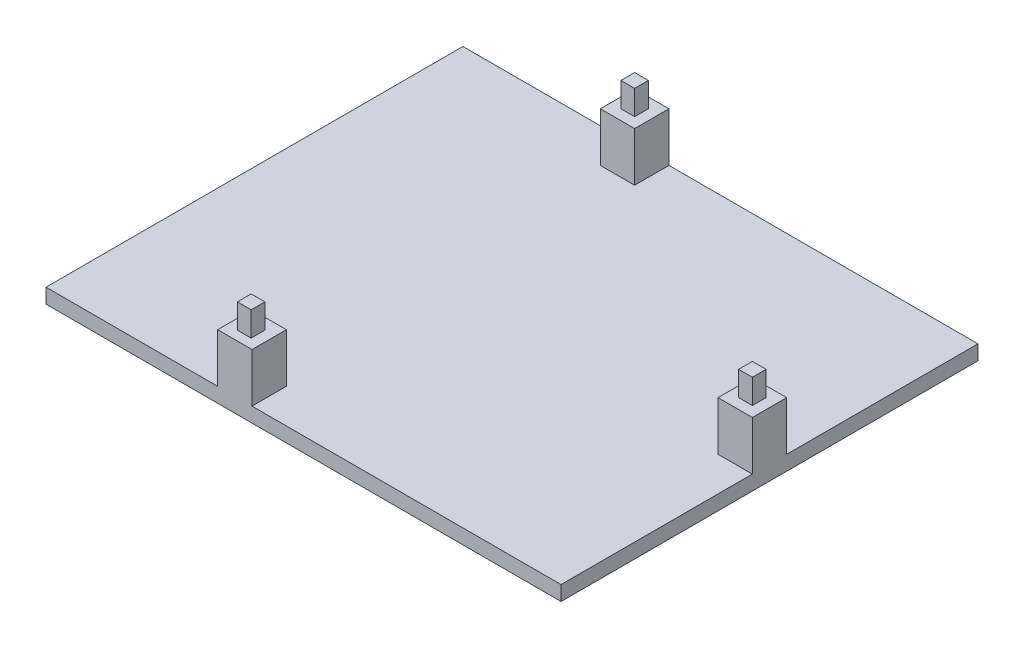
ISO-10303-21;
HEADER;
FILE_DESCRIPTION(('STEP AP214'),'2;1');
FILE_NAME('part.step','',(''),(''),'','','');
FILE_SCHEMA(('AUTOMOTIVE_DESIGN { 1 0 10303 214 1 1 1 1 }'));
ENDSEC;
DATA;
#1=APPLICATION_CONTEXT('core data for automotive mechanical design processes');
#2=APPLICATION_PROTOCOL_DEFINITION('international standard','automotive_design',2000,#1);
#3=PRODUCT_CONTEXT('',#1,'mechanical');
#4=PRODUCT('Part','Part','',(#3));
#5=PRODUCT_RELATED_PRODUCT_CATEGORY('part','',(#4));
#6=PRODUCT_DEFINITION_FORMATION('','',#4);
#7=PRODUCT_DEFINITION_CONTEXT('part definition',#1,'design');
#8=PRODUCT_DEFINITION('design','',#6,#7);
#9=PRODUCT_DEFINITION_SHAPE('','',#8);
#10=(LENGTH_UNIT() NAMED_UNIT(*) SI_UNIT(.MILLI.,.METRE.));
#11=(NAMED_UNIT(*) PLANE_ANGLE_UNIT() SI_UNIT($,.RADIAN.));
#12=(NAMED_UNIT(*) SI_UNIT($,.STERADIAN.) SOLID_ANGLE_UNIT());
#13=UNCERTAINTY_MEASURE_WITH_UNIT(LENGTH_MEASURE(1.E-05),#10,'distance_accuracy_value','');
#14=(GEOMETRIC_REPRESENTATION_CONTEXT(3) GLOBAL_UNCERTAINTY_ASSIGNED_CONTEXT((#13)) GLOBAL_UNIT_ASSIGNED_CONTEXT((#10,
#11,#12)) REPRESENTATION_CONTEXT('',''));
#15=CARTESIAN_POINT('',(0.,0.,0.));
#16=DIRECTION('',(0.,0.,1.));
#17=DIRECTION('',(1.,0.,0.));
#18=AXIS2_PLACEMENT_3D('',#15,#16,#17);
#19=CARTESIAN_POINT('',(0.,3.,0.));
#20=DIRECTION('',(0.,-1.,0.));
#21=DIRECTION('',(0.,0.,-1.));
#22=AXIS2_PLACEMENT_3D('',#19,#20,#21);
#23=PLANE('',#22);
#24=DIRECTION('',(0.,0.,-1.));
#25=VECTOR('',#24,1.);
#26=CARTESIAN_POINT('',(35.2097502972652,3.,0.));
#27=LINE('',#26,#25);
#28=CARTESIAN_POINT('',(35.2097502972652,3.,20.7510107015458));
#29=VERTEX_POINT('',#28);
#30=CARTESIAN_POINT('',(35.2097502972652,3.,13.7510107015458));
#31=VERTEX_POINT('',#30);
#32=EDGE_CURVE('E50',#29,#31,#27,.T.);
#33=ORIENTED_EDGE('',*,*,#32,.T.);
#34=DIRECTION('',(1.,0.,0.));
#35=VECTOR('',#34,1.);
#36=CARTESIAN_POINT('',(0.,3.,13.7510107015458));
#37=LINE('',#36,#35);
#38=CARTESIAN_POINT('',(42.2097502972652,3.,13.7510107015458));
#39=VERTEX_POINT('',#38);
#40=EDGE_CURVE('E225',#31,#39,#37,.T.);
#41=ORIENTED_EDGE('',*,*,#40,.T.);
#42=DIRECTION('',(0.,0.,-1.));
#43=VECTOR('',#42,1.);
#44=CARTESIAN_POINT('',(42.2097502972652,3.,-25.2489892984542));
#45=LINE('',#44,#43);
#46=CARTESIAN_POINT('',(42.2097502972652,3.,-25.2489892984542));
#47=VERTEX_POINT('',#46);
#48=EDGE_CURVE('E426',#39,#47,#45,.T.);
#49=ORIENTED_EDGE('',*,*,#48,.T.);
#50=DIRECTION('',(-1.,0.,0.));
#51=VECTOR('',#50,1.);
#52=CARTESIAN_POINT('',(-62.7902497027348,3.,-25.2489892984542));
#53=LINE('',#52,#51);
#54=CARTESIAN_POINT('',(-20.7902497027348,3.,-25.2489892984542));
#55=VERTEX_POINT('',#54);
#56=EDGE_CURVE('E430',#47,#55,#53,.T.);
#57=ORIENTED_EDGE('',*,*,#56,.T.);
#58=DIRECTION('',(0.,0.,-1.));
#59=VECTOR('',#58,1.);
#60=CARTESIAN_POINT('',(-20.7902497027348,3.,0.));
#61=LINE('',#60,#59);
#62=CARTESIAN_POINT('',(-20.7902497027348,3.,-18.2489892984542));
#63=VERTEX_POINT('',#62);
#64=EDGE_CURVE('E317',#63,#55,#61,.T.);
#65=ORIENTED_EDGE('',*,*,#64,.F.);
#66=DIRECTION('',(1.,0.,0.));
#67=VECTOR('',#66,1.);
#68=CARTESIAN_POINT('',(0.,3.,-18.2489892984542));
#69=LINE('',#68,#67);
#70=CARTESIAN_POINT('',(-27.7902497027348,3.,-18.2489892984542));
#71=VERTEX_POINT('',#70);
#72=EDGE_CURVE('E284',#71,#63,#69,.T.);
#73=ORIENTED_EDGE('',*,*,#72,.F.);
#74=DIRECTION('',(0.,0.,1.));
#75=VECTOR('',#74,1.);
#76=CARTESIAN_POINT('',(-27.7902497027348,3.,0.));
#77=LINE('',#76,#75);
#78=CARTESIAN_POINT('',(-27.7902497027348,3.,-25.2489892984542));
#79=VERTEX_POINT('',#78);
#80=EDGE_CURVE('E296',#79,#71,#77,.T.);
#81=ORIENTED_EDGE('',*,*,#80,.F.);
#82=CARTESIAN_POINT('',(-62.7902497027348,3.,-25.2489892984542));
#83=VERTEX_POINT('',#82);
#84=EDGE_CURVE('E429',#79,#83,#53,.T.);
#85=ORIENTED_EDGE('',*,*,#84,.T.);
#86=DIRECTION('',(0.,0.,1.));
#87=VECTOR('',#86,1.);
#88=CARTESIAN_POINT('',(-62.7902497027348,3.,59.7510107015458));
#89=LINE('',#88,#87);
#90=CARTESIAN_POINT('',(-62.7902497027348,3.,59.7510107015458));
#91=VERTEX_POINT('',#90);
#92=EDGE_CURVE('E419',#83,#91,#89,.T.);
#93=ORIENTED_EDGE('',*,*,#92,.T.);
#94=DIRECTION('',(1.,0.,0.));
#95=VECTOR('',#94,1.);
#96=CARTESIAN_POINT('',(42.2097502972652,3.,59.7510107015458));
#97=LINE('',#96,#95);
#98=CARTESIAN_POINT('',(-27.7902497027348,3.,59.7510107015458));
#99=VERTEX_POINT('',#98);
#100=EDGE_CURVE('E424',#91,#99,#97,.T.);
#101=ORIENTED_EDGE('',*,*,#100,.T.);
#102=DIRECTION('',(0.,0.,-1.));
#103=VECTOR('',#102,1.);
#104=CARTESIAN_POINT('',(-27.7902497027348,3.,0.));
#105=LINE('',#104,#103);
#106=CARTESIAN_POINT('',(-27.7902497027348,3.,52.7510107015458));
#107=VERTEX_POINT('',#106);
#108=EDGE_CURVE('E360',#99,#107,#105,.T.);
#109=ORIENTED_EDGE('',*,*,#108,.T.);
#110=DIRECTION('',(1.,0.,0.));
#111=VECTOR('',#110,1.);
#112=CARTESIAN_POINT('',(0.,3.,52.7510107015458));
#113=LINE('',#112,#111);
#114=CARTESIAN_POINT('',(-20.7902497027348,3.,52.7510107015458));
#115=VERTEX_POINT('',#114);
#116=EDGE_CURVE('E382',#107,#115,#113,.T.);
#117=ORIENTED_EDGE('',*,*,#116,.T.);
#118=DIRECTION('',(0.,0.,1.));
#119=VECTOR('',#118,1.);
#120=CARTESIAN_POINT('',(-20.7902497027348,3.,0.));
#121=LINE('',#120,#119);
#122=CARTESIAN_POINT('',(-20.7902497027348,3.,59.7510107015458));
#123=VERTEX_POINT('',#122);
#124=EDGE_CURVE('E355',#115,#123,#121,.T.);
#125=ORIENTED_EDGE('',*,*,#124,.T.);
#126=CARTESIAN_POINT('',(42.2097502972652,3.,59.7510107015458));
#127=VERTEX_POINT('',#126);
#128=EDGE_CURVE('E422',#123,#127,#97,.T.);
#129=ORIENTED_EDGE('',*,*,#128,.T.);
#130=CARTESIAN_POINT('',(42.2097502972652,3.,20.7510107015458));
#131=VERTEX_POINT('',#130);
#132=EDGE_CURVE('E427',#127,#131,#45,.T.);
#133=ORIENTED_EDGE('',*,*,#132,.T.);
#134=DIRECTION('',(-1.,0.,0.));
#135=VECTOR('',#134,1.);
#136=CARTESIAN_POINT('',(0.,3.,20.7510107015458));
#137=LINE('',#136,#135);
#138=EDGE_CURVE('E55',#131,#29,#137,.T.);
#139=ORIENTED_EDGE('',*,*,#138,.T.);
#140=EDGE_LOOP('',(#33,#41,#49,#57,#65,#73,#81,#85,#93,#101,#109,#117,#125,#129,#133,#139));
#141=FACE_BOUND('',#140,.T.);
#142=ADVANCED_FACE('F35',(#141),#23,.F.);
#143=CARTESIAN_POINT('',(-62.7902497027348,3.,59.7510107015458));
#144=DIRECTION('',(1.,0.,0.));
#145=DIRECTION('',(0.,0.,-1.));
#146=AXIS2_PLACEMENT_3D('',#143,#144,#145);
#147=PLANE('',#146);
#148=DIRECTION('',(0.,0.,1.));
#149=VECTOR('',#148,1.);
#150=CARTESIAN_POINT('',(-62.7902497027348,0.,59.7510107015458));
#151=LINE('',#150,#149);
#152=CARTESIAN_POINT('',(-62.7902497027348,0.,-25.2489892984542));
#153=VERTEX_POINT('',#152);
#154=CARTESIAN_POINT('',(-62.7902497027348,0.,59.7510107015458));
#155=VERTEX_POINT('',#154);
#156=EDGE_CURVE('E418',#153,#155,#151,.T.);
#157=ORIENTED_EDGE('',*,*,#156,.T.);
#158=DIRECTION('',(0.,-1.,0.));
#159=VECTOR('',#158,1.);
#160=CARTESIAN_POINT('',(-62.7902497027348,3.,59.7510107015458));
#161=LINE('',#160,#159);
#162=EDGE_CURVE('E11',#91,#155,#161,.T.);
#163=ORIENTED_EDGE('',*,*,#162,.F.);
#164=ORIENTED_EDGE('',*,*,#92,.F.);
#165=DIRECTION('',(0.,-1.,0.));
#166=VECTOR('',#165,1.);
#167=CARTESIAN_POINT('',(-62.7902497027348,3.,-25.2489892984542));
#168=LINE('',#167,#166);
#169=EDGE_CURVE('E432',#83,#153,#168,.T.);
#170=ORIENTED_EDGE('',*,*,#169,.T.);
#171=EDGE_LOOP('',(#157,#163,#164,#170));
#172=FACE_BOUND('',#171,.T.);
#173=ADVANCED_FACE('F37',(#172),#147,.F.);
#174=CARTESIAN_POINT('',(42.2097502972652,3.,59.7510107015458));
#175=DIRECTION('',(0.,0.,-1.));
#176=DIRECTION('',(-1.,0.,0.));
#177=AXIS2_PLACEMENT_3D('',#174,#175,#176);
#178=PLANE('',#177);
#179=DIRECTION('',(1.,0.,0.));
#180=VECTOR('',#179,1.);
#181=CARTESIAN_POINT('',(42.2097502972652,0.,59.7510107015458));
#182=LINE('',#181,#180);
#183=CARTESIAN_POINT('',(42.2097502972652,0.,59.7510107015458));
#184=VERTEX_POINT('',#183);
#185=EDGE_CURVE('E435',#155,#184,#182,.T.);
#186=ORIENTED_EDGE('',*,*,#185,.T.);
#187=DIRECTION('',(0.,-1.,0.));
#188=VECTOR('',#187,1.);
#189=CARTESIAN_POINT('',(42.2097502972652,3.,59.7510107015458));
#190=LINE('',#189,#188);
#191=EDGE_CURVE('E43',#127,#184,#190,.T.);
#192=ORIENTED_EDGE('',*,*,#191,.F.);
#193=ORIENTED_EDGE('',*,*,#128,.F.);
#194=DIRECTION('',(0.,-1.,0.));
#195=VECTOR('',#194,1.);
#196=CARTESIAN_POINT('',(-20.7902497027348,13.,59.7510107015458));
#197=LINE('',#196,#195);
#198=CARTESIAN_POINT('',(-20.7902497027348,13.,59.7510107015458));
#199=VERTEX_POINT('',#198);
#200=EDGE_CURVE('E379',#199,#123,#197,.T.);
#201=ORIENTED_EDGE('',*,*,#200,.F.);
#202=DIRECTION('',(1.,0.,0.));
#203=VECTOR('',#202,1.);
#204=CARTESIAN_POINT('',(0.,13.,59.7510107015458));
#205=LINE('',#204,#203);
#206=CARTESIAN_POINT('',(-27.7902497027348,13.,59.7510107015458));
#207=VERTEX_POINT('',#206);
#208=EDGE_CURVE('E366',#207,#199,#205,.T.);
#209=ORIENTED_EDGE('',*,*,#208,.F.);
#210=DIRECTION('',(0.,-1.,0.));
#211=VECTOR('',#210,1.);
#212=CARTESIAN_POINT('',(-27.7902497027348,13.,59.7510107015458));
#213=LINE('',#212,#211);
#214=EDGE_CURVE('E387',#207,#99,#213,.T.);
#215=ORIENTED_EDGE('',*,*,#214,.T.);
#216=ORIENTED_EDGE('',*,*,#100,.F.);
#217=ORIENTED_EDGE('',*,*,#162,.T.);
#218=EDGE_LOOP('',(#186,#192,#193,#201,#209,#215,#216,#217));
#219=FACE_BOUND('',#218,.T.);
#220=ADVANCED_FACE('F493',(#219),#178,.F.);
#221=CARTESIAN_POINT('',(42.2097502972652,3.,-25.2489892984542));
#222=DIRECTION('',(-1.,0.,0.));
#223=DIRECTION('',(0.,0.,1.));
#224=AXIS2_PLACEMENT_3D('',#221,#222,#223);
#225=PLANE('',#224);
#226=DIRECTION('',(0.,0.,-1.));
#227=VECTOR('',#226,1.);
#228=CARTESIAN_POINT('',(42.2097502972652,0.,-25.2489892984542));
#229=LINE('',#228,#227);
#230=CARTESIAN_POINT('',(42.2097502972652,0.,-25.2489892984542));
#231=VERTEX_POINT('',#230);
#232=EDGE_CURVE('E437',#184,#231,#229,.T.);
#233=ORIENTED_EDGE('',*,*,#232,.T.);
#234=DIRECTION('',(0.,-1.,0.));
#235=VECTOR('',#234,1.);
#236=CARTESIAN_POINT('',(42.2097502972652,3.,-25.2489892984542));
#237=LINE('',#236,#235);
#238=EDGE_CURVE('E442',#47,#231,#237,.T.);
#239=ORIENTED_EDGE('',*,*,#238,.F.);
#240=ORIENTED_EDGE('',*,*,#48,.F.);
#241=DIRECTION('',(0.,-1.,0.));
#242=VECTOR('',#241,1.);
#243=CARTESIAN_POINT('',(42.2097502972652,13.,13.7510107015458));
#244=LINE('',#243,#242);
#245=CARTESIAN_POINT('',(42.2097502972652,13.,13.7510107015458));
#246=VERTEX_POINT('',#245);
#247=EDGE_CURVE('E260',#246,#39,#244,.T.);
#248=ORIENTED_EDGE('',*,*,#247,.F.);
#249=DIRECTION('',(0.,0.,-1.));
#250=VECTOR('',#249,1.);
#251=CARTESIAN_POINT('',(42.2097502972652,13.,0.));
#252=LINE('',#251,#250);
#253=CARTESIAN_POINT('',(42.2097502972652,13.,20.7510107015458));
#254=VERTEX_POINT('',#253);
#255=EDGE_CURVE('E239',#254,#246,#252,.T.);
#256=ORIENTED_EDGE('',*,*,#255,.F.);
#257=DIRECTION('',(0.,-1.,0.));
#258=VECTOR('',#257,1.);
#259=CARTESIAN_POINT('',(42.2097502972652,13.,20.7510107015458));
#260=LINE('',#259,#258);
#261=EDGE_CURVE('E265',#254,#131,#260,.T.);
#262=ORIENTED_EDGE('',*,*,#261,.T.);
#263=ORIENTED_EDGE('',*,*,#132,.F.);
#264=ORIENTED_EDGE('',*,*,#191,.T.);
#265=EDGE_LOOP('',(#233,#239,#240,#248,#256,#262,#263,#264));
#266=FACE_BOUND('',#265,.T.);
#267=ADVANCED_FACE('F449',(#266),#225,.F.);
#268=CARTESIAN_POINT('',(-62.7902497027348,3.,-25.2489892984542));
#269=DIRECTION('',(0.,0.,1.));
#270=DIRECTION('',(1.,0.,0.));
#271=AXIS2_PLACEMENT_3D('',#268,#269,#270);
#272=PLANE('',#271);
#273=DIRECTION('',(-1.,0.,0.));
#274=VECTOR('',#273,1.);
#275=CARTESIAN_POINT('',(-62.7902497027348,0.,-25.2489892984542));
#276=LINE('',#275,#274);
#277=EDGE_CURVE('E423',#231,#153,#276,.T.);
#278=ORIENTED_EDGE('',*,*,#277,.T.);
#279=ORIENTED_EDGE('',*,*,#169,.F.);
#280=ORIENTED_EDGE('',*,*,#84,.F.);
#281=DIRECTION('',(0.,-1.,0.));
#282=VECTOR('',#281,1.);
#283=CARTESIAN_POINT('',(-27.7902497027348,13.,-25.2489892984542));
#284=LINE('',#283,#282);
#285=CARTESIAN_POINT('',(-27.7902497027348,13.,-25.2489892984542));
#286=VERTEX_POINT('',#285);
#287=EDGE_CURVE('E324',#286,#79,#284,.T.);
#288=ORIENTED_EDGE('',*,*,#287,.F.);
#289=DIRECTION('',(-1.,0.,0.));
#290=VECTOR('',#289,1.);
#291=CARTESIAN_POINT('',(0.,13.,-25.2489892984542));
#292=LINE('',#291,#290);
#293=CARTESIAN_POINT('',(-20.7902497027348,13.,-25.2489892984542));
#294=VERTEX_POINT('',#293);
#295=EDGE_CURVE('E310',#294,#286,#292,.T.);
#296=ORIENTED_EDGE('',*,*,#295,.F.);
#297=DIRECTION('',(0.,-1.,0.));
#298=VECTOR('',#297,1.);
#299=CARTESIAN_POINT('',(-20.7902497027348,13.,-25.2489892984542));
#300=LINE('',#299,#298);
#301=EDGE_CURVE('E327',#294,#55,#300,.T.);
#302=ORIENTED_EDGE('',*,*,#301,.T.);
#303=ORIENTED_EDGE('',*,*,#56,.F.);
#304=ORIENTED_EDGE('',*,*,#238,.T.);
#305=EDGE_LOOP('',(#278,#279,#280,#288,#296,#302,#303,#304));
#306=FACE_BOUND('',#305,.T.);
#307=ADVANCED_FACE('F458',(#306),#272,.F.);
#308=CARTESIAN_POINT('',(0.,0.,0.));
#309=DIRECTION('',(0.,-1.,0.));
#310=DIRECTION('',(0.,0.,-1.));
#311=AXIS2_PLACEMENT_3D('',#308,#309,#310);
#312=PLANE('',#311);
#313=ORIENTED_EDGE('',*,*,#156,.F.);
#314=ORIENTED_EDGE('',*,*,#277,.F.);
#315=ORIENTED_EDGE('',*,*,#232,.F.);
#316=ORIENTED_EDGE('',*,*,#185,.F.);
#317=EDGE_LOOP('',(#313,#314,#315,#316));
#318=FACE_BOUND('',#317,.T.);
#319=ADVANCED_FACE('F455',(#318),#312,.T.);
#320=CARTESIAN_POINT('',(-20.7902497027348,13.,0.));
#321=DIRECTION('',(1.,0.,0.));
#322=DIRECTION('',(0.,0.,-1.));
#323=AXIS2_PLACEMENT_3D('',#320,#321,#322);
#324=PLANE('',#323);
#325=ORIENTED_EDGE('',*,*,#124,.F.);
#326=DIRECTION('',(0.,-1.,0.));
#327=VECTOR('',#326,1.);
#328=CARTESIAN_POINT('',(-20.7902497027348,13.,52.7510107015458));
#329=LINE('',#328,#327);
#330=CARTESIAN_POINT('',(-20.7902497027348,13.,52.7510107015458));
#331=VERTEX_POINT('',#330);
#332=EDGE_CURVE('E393',#331,#115,#329,.T.);
#333=ORIENTED_EDGE('',*,*,#332,.F.);
#334=DIRECTION('',(0.,0.,1.));
#335=VECTOR('',#334,1.);
#336=CARTESIAN_POINT('',(-20.7902497027348,13.,0.));
#337=LINE('',#336,#335);
#338=EDGE_CURVE('E356',#331,#199,#337,.T.);
#339=ORIENTED_EDGE('',*,*,#338,.T.);
#340=ORIENTED_EDGE('',*,*,#200,.T.);
#341=EDGE_LOOP('',(#325,#333,#339,#340));
#342=FACE_BOUND('',#341,.T.);
#343=ADVANCED_FACE('F500',(#342),#324,.T.);
#344=CARTESIAN_POINT('',(0.,13.,52.7510107015458));
#345=DIRECTION('',(0.,0.,-1.));
#346=DIRECTION('',(-1.,0.,0.));
#347=AXIS2_PLACEMENT_3D('',#344,#345,#346);
#348=PLANE('',#347);
#349=ORIENTED_EDGE('',*,*,#116,.F.);
#350=DIRECTION('',(0.,-1.,0.));
#351=VECTOR('',#350,1.);
#352=CARTESIAN_POINT('',(-27.7902497027348,13.,52.7510107015458));
#353=LINE('',#352,#351);
#354=CARTESIAN_POINT('',(-27.7902497027348,13.,52.7510107015458));
#355=VERTEX_POINT('',#354);
#356=EDGE_CURVE('E390',#355,#107,#353,.T.);
#357=ORIENTED_EDGE('',*,*,#356,.F.);
#358=DIRECTION('',(1.,0.,0.));
#359=VECTOR('',#358,1.);
#360=CARTESIAN_POINT('',(0.,13.,52.7510107015458));
#361=LINE('',#360,#359);
#362=EDGE_CURVE('E359',#355,#331,#361,.T.);
#363=ORIENTED_EDGE('',*,*,#362,.T.);
#364=ORIENTED_EDGE('',*,*,#332,.T.);
#365=EDGE_LOOP('',(#349,#357,#363,#364));
#366=FACE_BOUND('',#365,.T.);
#367=ADVANCED_FACE('F516',(#366),#348,.T.);
#368=CARTESIAN_POINT('',(-27.7902497027348,13.,0.));
#369=DIRECTION('',(-1.,0.,0.));
#370=DIRECTION('',(0.,0.,1.));
#371=AXIS2_PLACEMENT_3D('',#368,#369,#370);
#372=PLANE('',#371);
#373=ORIENTED_EDGE('',*,*,#108,.F.);
#374=ORIENTED_EDGE('',*,*,#214,.F.);
#375=DIRECTION('',(0.,0.,-1.));
#376=VECTOR('',#375,1.);
#377=CARTESIAN_POINT('',(-27.7902497027348,13.,0.));
#378=LINE('',#377,#376);
#379=EDGE_CURVE('E363',#207,#355,#378,.T.);
#380=ORIENTED_EDGE('',*,*,#379,.T.);
#381=ORIENTED_EDGE('',*,*,#356,.T.);
#382=EDGE_LOOP('',(#373,#374,#380,#381));
#383=FACE_BOUND('',#382,.T.);
#384=ADVANCED_FACE('F512',(#383),#372,.T.);
#385=CARTESIAN_POINT('',(0.,13.,0.));
#386=DIRECTION('',(0.,1.,0.));
#387=DIRECTION('',(0.,0.,1.));
#388=AXIS2_PLACEMENT_3D('',#385,#386,#387);
#389=PLANE('',#388);
#390=ORIENTED_EDGE('',*,*,#338,.F.);
#391=ORIENTED_EDGE('',*,*,#362,.F.);
#392=ORIENTED_EDGE('',*,*,#379,.F.);
#393=ORIENTED_EDGE('',*,*,#208,.T.);
#394=EDGE_LOOP('',(#390,#391,#392,#393));
#395=FACE_BOUND('',#394,.T.);
#396=DIRECTION('',(0.,0.,1.));
#397=VECTOR('',#396,1.);
#398=CARTESIAN_POINT('',(-22.8902497027348,13.,0.));
#399=LINE('',#398,#397);
#400=CARTESIAN_POINT('',(-22.8902497027348,13.,55.0308565658858));
#401=VERTEX_POINT('',#400);
#402=CARTESIAN_POINT('',(-22.8902497027348,13.,57.8308565658858));
#403=VERTEX_POINT('',#402);
#404=EDGE_CURVE('E368',#401,#403,#399,.T.);
#405=ORIENTED_EDGE('',*,*,#404,.T.);
#406=DIRECTION('',(-1.,0.,0.));
#407=VECTOR('',#406,1.);
#408=CARTESIAN_POINT('',(0.,13.,57.8308565658858));
#409=LINE('',#408,#407);
#410=CARTESIAN_POINT('',(-25.6902497027348,13.,57.8308565658858));
#411=VERTEX_POINT('',#410);
#412=EDGE_CURVE('E371',#403,#411,#409,.T.);
#413=ORIENTED_EDGE('',*,*,#412,.T.);
#414=DIRECTION('',(0.,0.,1.));
#415=VECTOR('',#414,1.);
#416=CARTESIAN_POINT('',(-25.6902497027348,13.,0.));
#417=LINE('',#416,#415);
#418=CARTESIAN_POINT('',(-25.6902497027348,13.,55.0308565658858));
#419=VERTEX_POINT('',#418);
#420=EDGE_CURVE('E374',#419,#411,#417,.T.);
#421=ORIENTED_EDGE('',*,*,#420,.F.);
#422=DIRECTION('',(1.,0.,0.));
#423=VECTOR('',#422,1.);
#424=CARTESIAN_POINT('',(0.,13.,55.0308565658858));
#425=LINE('',#424,#423);
#426=EDGE_CURVE('E376',#419,#401,#425,.T.);
#427=ORIENTED_EDGE('',*,*,#426,.T.);
#428=EDGE_LOOP('',(#405,#413,#421,#427));
#429=FACE_BOUND('',#428,.T.);
#430=ADVANCED_FACE('F521',(#395,#429),#389,.T.);
#431=CARTESIAN_POINT('',(0.,18.,0.));
#432=DIRECTION('',(0.,-1.,0.));
#433=DIRECTION('',(0.,0.,-1.));
#434=AXIS2_PLACEMENT_3D('',#431,#432,#433);
#435=PLANE('',#434);
#436=DIRECTION('',(0.,0.,1.));
#437=VECTOR('',#436,1.);
#438=CARTESIAN_POINT('',(-25.6902497027348,18.,55.0308565658858));
#439=LINE('',#438,#437);
#440=CARTESIAN_POINT('',(-25.6902497027348,18.,55.0308565658858));
#441=VERTEX_POINT('',#440);
#442=CARTESIAN_POINT('',(-25.6902497027348,18.,57.8308565658858));
#443=VERTEX_POINT('',#442);
#444=EDGE_CURVE('E396',#441,#443,#439,.T.);
#445=ORIENTED_EDGE('',*,*,#444,.T.);
#446=DIRECTION('',(-1.,0.,0.));
#447=VECTOR('',#446,1.);
#448=CARTESIAN_POINT('',(-22.8902497027348,18.,57.8308565658858));
#449=LINE('',#448,#447);
#450=CARTESIAN_POINT('',(-22.8902497027348,18.,57.8308565658858));
#451=VERTEX_POINT('',#450);
#452=EDGE_CURVE('E398',#451,#443,#449,.T.);
#453=ORIENTED_EDGE('',*,*,#452,.F.);
#454=DIRECTION('',(0.,0.,1.));
#455=VECTOR('',#454,1.);
#456=CARTESIAN_POINT('',(-22.8902497027348,18.,55.0308565658858));
#457=LINE('',#456,#455);
#458=CARTESIAN_POINT('',(-22.8902497027348,18.,55.0308565658858));
#459=VERTEX_POINT('',#458);
#460=EDGE_CURVE('E401',#459,#451,#457,.T.);
#461=ORIENTED_EDGE('',*,*,#460,.F.);
#462=DIRECTION('',(1.,0.,0.));
#463=VECTOR('',#462,1.);
#464=CARTESIAN_POINT('',(-25.6902497027348,18.,55.0308565658858));
#465=LINE('',#464,#463);
#466=EDGE_CURVE('E404',#441,#459,#465,.T.);
#467=ORIENTED_EDGE('',*,*,#466,.F.);
#468=EDGE_LOOP('',(#445,#453,#461,#467));
#469=FACE_BOUND('',#468,.T.);
#470=ADVANCED_FACE('F524',(#469),#435,.F.);
#471=CARTESIAN_POINT('',(-25.6902497027348,18.,55.0308565658858));
#472=DIRECTION('',(0.,0.,-1.));
#473=DIRECTION('',(-1.,0.,0.));
#474=AXIS2_PLACEMENT_3D('',#471,#472,#473);
#475=PLANE('',#474);
#476=ORIENTED_EDGE('',*,*,#426,.F.);
#477=DIRECTION('',(0.,-1.,0.));
#478=VECTOR('',#477,1.);
#479=CARTESIAN_POINT('',(-25.6902497027348,18.,55.0308565658858));
#480=LINE('',#479,#478);
#481=EDGE_CURVE('E407',#441,#419,#480,.T.);
#482=ORIENTED_EDGE('',*,*,#481,.F.);
#483=ORIENTED_EDGE('',*,*,#466,.T.);
#484=DIRECTION('',(0.,-1.,0.));
#485=VECTOR('',#484,1.);
#486=CARTESIAN_POINT('',(-22.8902497027348,18.,55.0308565658858));
#487=LINE('',#486,#485);
#488=EDGE_CURVE('E410',#459,#401,#487,.T.);
#489=ORIENTED_EDGE('',*,*,#488,.T.);
#490=EDGE_LOOP('',(#476,#482,#483,#489));
#491=FACE_BOUND('',#490,.T.);
#492=ADVANCED_FACE('F540',(#491),#475,.T.);
#493=CARTESIAN_POINT('',(-22.8902497027348,18.,55.0308565658858));
#494=DIRECTION('',(1.,0.,0.));
#495=DIRECTION('',(0.,0.,-1.));
#496=AXIS2_PLACEMENT_3D('',#493,#494,#495);
#497=PLANE('',#496);
#498=ORIENTED_EDGE('',*,*,#404,.F.);
#499=ORIENTED_EDGE('',*,*,#488,.F.);
#500=ORIENTED_EDGE('',*,*,#460,.T.);
#501=DIRECTION('',(0.,-1.,0.));
#502=VECTOR('',#501,1.);
#503=CARTESIAN_POINT('',(-22.8902497027348,18.,57.8308565658858));
#504=LINE('',#503,#502);
#505=EDGE_CURVE('E412',#451,#403,#504,.T.);
#506=ORIENTED_EDGE('',*,*,#505,.T.);
#507=EDGE_LOOP('',(#498,#499,#500,#506));
#508=FACE_BOUND('',#507,.T.);
#509=ADVANCED_FACE('F529',(#508),#497,.T.);
#510=CARTESIAN_POINT('',(-22.8902497027348,18.,57.8308565658858));
#511=DIRECTION('',(0.,0.,1.));
#512=DIRECTION('',(1.,0.,0.));
#513=AXIS2_PLACEMENT_3D('',#510,#511,#512);
#514=PLANE('',#513);
#515=ORIENTED_EDGE('',*,*,#412,.F.);
#516=ORIENTED_EDGE('',*,*,#505,.F.);
#517=ORIENTED_EDGE('',*,*,#452,.T.);
#518=DIRECTION('',(0.,-1.,0.));
#519=VECTOR('',#518,1.);
#520=CARTESIAN_POINT('',(-25.6902497027348,18.,57.8308565658858));
#521=LINE('',#520,#519);
#522=EDGE_CURVE('E415',#443,#411,#521,.T.);
#523=ORIENTED_EDGE('',*,*,#522,.T.);
#524=EDGE_LOOP('',(#515,#516,#517,#523));
#525=FACE_BOUND('',#524,.T.);
#526=ADVANCED_FACE('F533',(#525),#514,.T.);
#527=CARTESIAN_POINT('',(-25.6902497027348,18.,55.0308565658858));
#528=DIRECTION('',(1.,0.,0.));
#529=DIRECTION('',(0.,0.,-1.));
#530=AXIS2_PLACEMENT_3D('',#527,#528,#529);
#531=PLANE('',#530);
#532=ORIENTED_EDGE('',*,*,#481,.T.);
#533=ORIENTED_EDGE('',*,*,#420,.T.);
#534=ORIENTED_EDGE('',*,*,#522,.F.);
#535=ORIENTED_EDGE('',*,*,#444,.F.);
#536=EDGE_LOOP('',(#532,#533,#534,#535));
#537=FACE_BOUND('',#536,.T.);
#538=ADVANCED_FACE('F496',(#537),#531,.F.);
#539=CARTESIAN_POINT('',(0.,13.,-18.2489892984542));
#540=DIRECTION('',(0.,0.,-1.));
#541=DIRECTION('',(-1.,0.,0.));
#542=AXIS2_PLACEMENT_3D('',#539,#540,#541);
#543=PLANE('',#542);
#544=ORIENTED_EDGE('',*,*,#72,.T.);
#545=DIRECTION('',(0.,-1.,0.));
#546=VECTOR('',#545,1.);
#547=CARTESIAN_POINT('',(-20.7902497027348,13.,-18.2489892984542));
#548=LINE('',#547,#546);
#549=CARTESIAN_POINT('',(-20.7902497027348,13.,-18.2489892984542));
#550=VERTEX_POINT('',#549);
#551=EDGE_CURVE('E330',#550,#63,#548,.T.);
#552=ORIENTED_EDGE('',*,*,#551,.F.);
#553=DIRECTION('',(1.,0.,0.));
#554=VECTOR('',#553,1.);
#555=CARTESIAN_POINT('',(0.,13.,-18.2489892984542));
#556=LINE('',#555,#554);
#557=CARTESIAN_POINT('',(-27.7902497027348,13.,-18.2489892984542));
#558=VERTEX_POINT('',#557);
#559=EDGE_CURVE('E305',#558,#550,#556,.T.);
#560=ORIENTED_EDGE('',*,*,#559,.F.);
#561=DIRECTION('',(0.,-1.,0.));
#562=VECTOR('',#561,1.);
#563=CARTESIAN_POINT('',(-27.7902497027348,13.,-18.2489892984542));
#564=LINE('',#563,#562);
#565=EDGE_CURVE('E314',#558,#71,#564,.T.);
#566=ORIENTED_EDGE('',*,*,#565,.T.);
#567=EDGE_LOOP('',(#544,#552,#560,#566));
#568=FACE_BOUND('',#567,.T.);
#569=ADVANCED_FACE('F554',(#568),#543,.F.);
#570=CARTESIAN_POINT('',(-20.7902497027348,13.,0.));
#571=DIRECTION('',(-1.,0.,0.));
#572=DIRECTION('',(0.,0.,1.));
#573=AXIS2_PLACEMENT_3D('',#570,#571,#572);
#574=PLANE('',#573);
#575=ORIENTED_EDGE('',*,*,#64,.T.);
#576=ORIENTED_EDGE('',*,*,#301,.F.);
#577=DIRECTION('',(0.,0.,-1.));
#578=VECTOR('',#577,1.);
#579=CARTESIAN_POINT('',(-20.7902497027348,13.,0.));
#580=LINE('',#579,#578);
#581=EDGE_CURVE('E308',#550,#294,#580,.T.);
#582=ORIENTED_EDGE('',*,*,#581,.F.);
#583=ORIENTED_EDGE('',*,*,#551,.T.);
#584=EDGE_LOOP('',(#575,#576,#582,#583));
#585=FACE_BOUND('',#584,.T.);
#586=ADVANCED_FACE('F476',(#585),#574,.F.);
#587=CARTESIAN_POINT('',(-27.7902497027348,13.,0.));
#588=DIRECTION('',(1.,0.,0.));
#589=DIRECTION('',(0.,0.,-1.));
#590=AXIS2_PLACEMENT_3D('',#587,#588,#589);
#591=PLANE('',#590);
#592=ORIENTED_EDGE('',*,*,#80,.T.);
#593=ORIENTED_EDGE('',*,*,#565,.F.);
#594=DIRECTION('',(0.,0.,1.));
#595=VECTOR('',#594,1.);
#596=CARTESIAN_POINT('',(-27.7902497027348,13.,0.));
#597=LINE('',#596,#595);
#598=EDGE_CURVE('E312',#286,#558,#597,.T.);
#599=ORIENTED_EDGE('',*,*,#598,.F.);
#600=ORIENTED_EDGE('',*,*,#287,.T.);
#601=EDGE_LOOP('',(#592,#593,#599,#600));
#602=FACE_BOUND('',#601,.T.);
#603=ADVANCED_FACE('F469',(#602),#591,.F.);
#604=CARTESIAN_POINT('',(0.,13.,0.));
#605=DIRECTION('',(0.,1.,0.));
#606=DIRECTION('',(0.,0.,1.));
#607=AXIS2_PLACEMENT_3D('',#604,#605,#606);
#608=PLANE('',#607);
#609=DIRECTION('',(0.,0.,1.));
#610=VECTOR('',#609,1.);
#611=CARTESIAN_POINT('',(-22.8902497027348,13.,0.));
#612=LINE('',#611,#610);
#613=CARTESIAN_POINT('',(-22.8902497027348,13.,-23.1489892984542));
#614=VERTEX_POINT('',#613);
#615=CARTESIAN_POINT('',(-22.8902497027348,13.,-20.3489892984542));
#616=VERTEX_POINT('',#615);
#617=EDGE_CURVE('E292',#614,#616,#612,.T.);
#618=ORIENTED_EDGE('',*,*,#617,.T.);
#619=DIRECTION('',(-1.,0.,0.));
#620=VECTOR('',#619,1.);
#621=CARTESIAN_POINT('',(0.,13.,-20.3489892984542));
#622=LINE('',#621,#620);
#623=CARTESIAN_POINT('',(-25.6902497027348,13.,-20.3489892984542));
#624=VERTEX_POINT('',#623);
#625=EDGE_CURVE('E295',#616,#624,#622,.T.);
#626=ORIENTED_EDGE('',*,*,#625,.T.);
#627=DIRECTION('',(0.,0.,-1.));
#628=VECTOR('',#627,1.);
#629=CARTESIAN_POINT('',(-25.6902497027348,13.,0.));
#630=LINE('',#629,#628);
#631=CARTESIAN_POINT('',(-25.6902497027348,13.,-23.1489892984542));
#632=VERTEX_POINT('',#631);
#633=EDGE_CURVE('E299',#624,#632,#630,.T.);
#634=ORIENTED_EDGE('',*,*,#633,.T.);
#635=DIRECTION('',(1.,0.,0.));
#636=VECTOR('',#635,1.);
#637=CARTESIAN_POINT('',(0.,13.,-23.1489892984542));
#638=LINE('',#637,#636);
#639=EDGE_CURVE('E302',#632,#614,#638,.T.);
#640=ORIENTED_EDGE('',*,*,#639,.T.);
#641=EDGE_LOOP('',(#618,#626,#634,#640));
#642=FACE_BOUND('',#641,.T.);
#643=ORIENTED_EDGE('',*,*,#559,.T.);
#644=ORIENTED_EDGE('',*,*,#581,.T.);
#645=ORIENTED_EDGE('',*,*,#295,.T.);
#646=ORIENTED_EDGE('',*,*,#598,.T.);
#647=EDGE_LOOP('',(#643,#644,#645,#646));
#648=FACE_BOUND('',#647,.T.);
#649=ADVANCED_FACE('F472',(#642,#648),#608,.T.);
#650=CARTESIAN_POINT('',(0.,18.,0.));
#651=DIRECTION('',(0.,1.,0.));
#652=DIRECTION('',(0.,0.,1.));
#653=AXIS2_PLACEMENT_3D('',#650,#651,#652);
#654=PLANE('',#653);
#655=DIRECTION('',(1.,0.,0.));
#656=VECTOR('',#655,1.);
#657=CARTESIAN_POINT('',(-25.6902497027348,18.,-20.3489892984542));
#658=LINE('',#657,#656);
#659=CARTESIAN_POINT('',(-25.6902497027348,18.,-20.3489892984542));
#660=VERTEX_POINT('',#659);
#661=CARTESIAN_POINT('',(-22.8902497027348,18.,-20.3489892984542));
#662=VERTEX_POINT('',#661);
#663=EDGE_CURVE('E333',#660,#662,#658,.T.);
#664=ORIENTED_EDGE('',*,*,#663,.T.);
#665=DIRECTION('',(0.,0.,-1.));
#666=VECTOR('',#665,1.);
#667=CARTESIAN_POINT('',(-22.8902497027348,18.,-20.3489892984542));
#668=LINE('',#667,#666);
#669=CARTESIAN_POINT('',(-22.8902497027348,18.,-23.1489892984542));
#670=VERTEX_POINT('',#669);
#671=EDGE_CURVE('E336',#662,#670,#668,.T.);
#672=ORIENTED_EDGE('',*,*,#671,.T.);
#673=DIRECTION('',(1.,0.,0.));
#674=VECTOR('',#673,1.);
#675=CARTESIAN_POINT('',(-25.6902497027348,18.,-23.1489892984542));
#676=LINE('',#675,#674);
#677=CARTESIAN_POINT('',(-25.6902497027348,18.,-23.1489892984542));
#678=VERTEX_POINT('',#677);
#679=EDGE_CURVE('E338',#678,#670,#676,.T.);
#680=ORIENTED_EDGE('',*,*,#679,.F.);
#681=DIRECTION('',(0.,0.,-1.));
#682=VECTOR('',#681,1.);
#683=CARTESIAN_POINT('',(-25.6902497027348,18.,-20.3489892984542));
#684=LINE('',#683,#682);
#685=EDGE_CURVE('E341',#660,#678,#684,.T.);
#686=ORIENTED_EDGE('',*,*,#685,.F.);
#687=EDGE_LOOP('',(#664,#672,#680,#686));
#688=FACE_BOUND('',#687,.T.);
#689=ADVANCED_FACE('F566',(#688),#654,.T.);
#690=CARTESIAN_POINT('',(-25.6902497027348,18.,-20.3489892984542));
#691=DIRECTION('',(-1.,0.,0.));
#692=DIRECTION('',(0.,0.,1.));
#693=AXIS2_PLACEMENT_3D('',#690,#691,#692);
#694=PLANE('',#693);
#695=ORIENTED_EDGE('',*,*,#633,.F.);
#696=DIRECTION('',(0.,-1.,0.));
#697=VECTOR('',#696,1.);
#698=CARTESIAN_POINT('',(-25.6902497027348,18.,-20.3489892984542));
#699=LINE('',#698,#697);
#700=EDGE_CURVE('E344',#660,#624,#699,.T.);
#701=ORIENTED_EDGE('',*,*,#700,.F.);
#702=ORIENTED_EDGE('',*,*,#685,.T.);
#703=DIRECTION('',(0.,-1.,0.));
#704=VECTOR('',#703,1.);
#705=CARTESIAN_POINT('',(-25.6902497027348,18.,-23.1489892984542));
#706=LINE('',#705,#704);
#707=EDGE_CURVE('E347',#678,#632,#706,.T.);
#708=ORIENTED_EDGE('',*,*,#707,.T.);
#709=EDGE_LOOP('',(#695,#701,#702,#708));
#710=FACE_BOUND('',#709,.T.);
#711=ADVANCED_FACE('F569',(#710),#694,.T.);
#712=CARTESIAN_POINT('',(-25.6902497027348,18.,-23.1489892984542));
#713=DIRECTION('',(0.,0.,-1.));
#714=DIRECTION('',(-1.,0.,0.));
#715=AXIS2_PLACEMENT_3D('',#712,#713,#714);
#716=PLANE('',#715);
#717=ORIENTED_EDGE('',*,*,#639,.F.);
#718=ORIENTED_EDGE('',*,*,#707,.F.);
#719=ORIENTED_EDGE('',*,*,#679,.T.);
#720=DIRECTION('',(0.,-1.,0.));
#721=VECTOR('',#720,1.);
#722=CARTESIAN_POINT('',(-22.8902497027348,18.,-23.1489892984542));
#723=LINE('',#722,#721);
#724=EDGE_CURVE('E349',#670,#614,#723,.T.);
#725=ORIENTED_EDGE('',*,*,#724,.T.);
#726=EDGE_LOOP('',(#717,#718,#719,#725));
#727=FACE_BOUND('',#726,.T.);
#728=ADVANCED_FACE('F573',(#727),#716,.T.);
#729=CARTESIAN_POINT('',(-22.8902497027348,18.,-20.3489892984542));
#730=DIRECTION('',(-1.,0.,0.));
#731=DIRECTION('',(0.,0.,1.));
#732=AXIS2_PLACEMENT_3D('',#729,#730,#731);
#733=PLANE('',#732);
#734=DIRECTION('',(0.,-1.,0.));
#735=VECTOR('',#734,1.);
#736=CARTESIAN_POINT('',(-22.8902497027348,18.,-20.3489892984542));
#737=LINE('',#736,#735);
#738=EDGE_CURVE('E352',#662,#616,#737,.T.);
#739=ORIENTED_EDGE('',*,*,#738,.T.);
#740=ORIENTED_EDGE('',*,*,#617,.F.);
#741=ORIENTED_EDGE('',*,*,#724,.F.);
#742=ORIENTED_EDGE('',*,*,#671,.F.);
#743=EDGE_LOOP('',(#739,#740,#741,#742));
#744=FACE_BOUND('',#743,.T.);
#745=ADVANCED_FACE('F577',(#744),#733,.F.);
#746=CARTESIAN_POINT('',(-25.6902497027348,18.,-20.3489892984542));
#747=DIRECTION('',(0.,0.,-1.));
#748=DIRECTION('',(-1.,0.,0.));
#749=AXIS2_PLACEMENT_3D('',#746,#747,#748);
#750=PLANE('',#749);
#751=ORIENTED_EDGE('',*,*,#700,.T.);
#752=ORIENTED_EDGE('',*,*,#625,.F.);
#753=ORIENTED_EDGE('',*,*,#738,.F.);
#754=ORIENTED_EDGE('',*,*,#663,.F.);
#755=EDGE_LOOP('',(#751,#752,#753,#754));
#756=FACE_BOUND('',#755,.T.);
#757=ADVANCED_FACE('F581',(#756),#750,.F.);
#758=CARTESIAN_POINT('',(0.,13.,13.7510107015458));
#759=DIRECTION('',(0.,0.,-1.));
#760=DIRECTION('',(-1.,0.,0.));
#761=AXIS2_PLACEMENT_3D('',#758,#759,#760);
#762=PLANE('',#761);
#763=ORIENTED_EDGE('',*,*,#40,.F.);
#764=DIRECTION('',(0.,-1.,0.));
#765=VECTOR('',#764,1.);
#766=CARTESIAN_POINT('',(35.2097502972652,13.,13.7510107015458));
#767=LINE('',#766,#765);
#768=CARTESIAN_POINT('',(35.2097502972652,13.,13.7510107015458));
#769=VERTEX_POINT('',#768);
#770=EDGE_CURVE('E220',#769,#31,#767,.T.);
#771=ORIENTED_EDGE('',*,*,#770,.F.);
#772=DIRECTION('',(1.,0.,0.));
#773=VECTOR('',#772,1.);
#774=CARTESIAN_POINT('',(0.,13.,13.7510107015458));
#775=LINE('',#774,#773);
#776=EDGE_CURVE('E224',#769,#246,#775,.T.);
#777=ORIENTED_EDGE('',*,*,#776,.T.);
#778=ORIENTED_EDGE('',*,*,#247,.T.);
#779=EDGE_LOOP('',(#763,#771,#777,#778));
#780=FACE_BOUND('',#779,.T.);
#781=ADVANCED_FACE('F222',(#780),#762,.T.);
#782=CARTESIAN_POINT('',(35.2097502972652,13.,0.));
#783=DIRECTION('',(-1.,0.,0.));
#784=DIRECTION('',(0.,0.,1.));
#785=AXIS2_PLACEMENT_3D('',#782,#783,#784);
#786=PLANE('',#785);
#787=ORIENTED_EDGE('',*,*,#32,.F.);
#788=DIRECTION('',(0.,-1.,0.));
#789=VECTOR('',#788,1.);
#790=CARTESIAN_POINT('',(35.2097502972652,13.,20.7510107015458));
#791=LINE('',#790,#789);
#792=CARTESIAN_POINT('',(35.2097502972652,13.,20.7510107015458));
#793=VERTEX_POINT('',#792);
#794=EDGE_CURVE('E229',#793,#29,#791,.T.);
#795=ORIENTED_EDGE('',*,*,#794,.F.);
#796=DIRECTION('',(0.,0.,-1.));
#797=VECTOR('',#796,1.);
#798=CARTESIAN_POINT('',(35.2097502972652,13.,0.));
#799=LINE('',#798,#797);
#800=EDGE_CURVE('E236',#793,#769,#799,.T.);
#801=ORIENTED_EDGE('',*,*,#800,.T.);
#802=ORIENTED_EDGE('',*,*,#770,.T.);
#803=EDGE_LOOP('',(#787,#795,#801,#802));
#804=FACE_BOUND('',#803,.T.);
#805=ADVANCED_FACE('F242',(#804),#786,.T.);
#806=CARTESIAN_POINT('',(0.,13.,20.7510107015458));
#807=DIRECTION('',(0.,0.,1.));
#808=DIRECTION('',(1.,0.,0.));
#809=AXIS2_PLACEMENT_3D('',#806,#807,#808);
#810=PLANE('',#809);
#811=ORIENTED_EDGE('',*,*,#138,.F.);
#812=ORIENTED_EDGE('',*,*,#261,.F.);
#813=DIRECTION('',(-1.,0.,0.));
#814=VECTOR('',#813,1.);
#815=CARTESIAN_POINT('',(0.,13.,20.7510107015458));
#816=LINE('',#815,#814);
#817=EDGE_CURVE('E243',#254,#793,#816,.T.);
#818=ORIENTED_EDGE('',*,*,#817,.T.);
#819=ORIENTED_EDGE('',*,*,#794,.T.);
#820=EDGE_LOOP('',(#811,#812,#818,#819));
#821=FACE_BOUND('',#820,.T.);
#822=ADVANCED_FACE('F478',(#821),#810,.T.);
#823=CARTESIAN_POINT('',(0.,13.,0.));
#824=DIRECTION('',(0.,1.,0.));
#825=DIRECTION('',(0.,0.,1.));
#826=AXIS2_PLACEMENT_3D('',#823,#824,#825);
#827=PLANE('',#826);
#828=ORIENTED_EDGE('',*,*,#776,.F.);
#829=ORIENTED_EDGE('',*,*,#800,.F.);
#830=ORIENTED_EDGE('',*,*,#817,.F.);
#831=ORIENTED_EDGE('',*,*,#255,.T.);
#832=EDGE_LOOP('',(#828,#829,#830,#831));
#833=FACE_BOUND('',#832,.T.);
#834=DIRECTION('',(1.,0.,0.));
#835=VECTOR('',#834,1.);
#836=CARTESIAN_POINT('',(0.,13.,15.8510107015458));
#837=LINE('',#836,#835);
#838=CARTESIAN_POINT('',(37.3097502972652,13.,15.8510107015458));
#839=VERTEX_POINT('',#838);
#840=CARTESIAN_POINT('',(40.1097502972652,13.,15.8510107015458));
#841=VERTEX_POINT('',#840);
#842=EDGE_CURVE('E248',#839,#841,#837,.T.);
#843=ORIENTED_EDGE('',*,*,#842,.T.);
#844=DIRECTION('',(0.,0.,1.));
#845=VECTOR('',#844,1.);
#846=CARTESIAN_POINT('',(40.1097502972652,13.,0.));
#847=LINE('',#846,#845);
#848=CARTESIAN_POINT('',(40.1097502972652,13.,18.6510107015458));
#849=VERTEX_POINT('',#848);
#850=EDGE_CURVE('E251',#841,#849,#847,.T.);
#851=ORIENTED_EDGE('',*,*,#850,.T.);
#852=DIRECTION('',(-1.,0.,0.));
#853=VECTOR('',#852,1.);
#854=CARTESIAN_POINT('',(0.,13.,18.6510107015458));
#855=LINE('',#854,#853);
#856=CARTESIAN_POINT('',(37.3097502972652,13.,18.6510107015458));
#857=VERTEX_POINT('',#856);
#858=EDGE_CURVE('E254',#849,#857,#855,.T.);
#859=ORIENTED_EDGE('',*,*,#858,.T.);
#860=DIRECTION('',(0.,0.,-1.));
#861=VECTOR('',#860,1.);
#862=CARTESIAN_POINT('',(37.3097502972652,13.,0.));
#863=LINE('',#862,#861);
#864=EDGE_CURVE('E257',#857,#839,#863,.T.);
#865=ORIENTED_EDGE('',*,*,#864,.T.);
#866=EDGE_LOOP('',(#843,#851,#859,#865));
#867=FACE_BOUND('',#866,.T.);
#868=ADVANCED_FACE('F233',(#833,#867),#827,.T.);
#869=CARTESIAN_POINT('',(0.,18.,0.));
#870=DIRECTION('',(0.,-1.,0.));
#871=DIRECTION('',(0.,0.,-1.));
#872=AXIS2_PLACEMENT_3D('',#869,#870,#871);
#873=PLANE('',#872);
#874=DIRECTION('',(-1.,0.,0.));
#875=VECTOR('',#874,1.);
#876=CARTESIAN_POINT('',(40.1097502972652,18.,18.6510107015458));
#877=LINE('',#876,#875);
#878=CARTESIAN_POINT('',(40.1097502972652,18.,18.6510107015458));
#879=VERTEX_POINT('',#878);
#880=CARTESIAN_POINT('',(37.3097502972652,18.,18.6510107015458));
#881=VERTEX_POINT('',#880);
#882=EDGE_CURVE('E228',#879,#881,#877,.T.);
#883=ORIENTED_EDGE('',*,*,#882,.F.);
#884=DIRECTION('',(0.,0.,1.));
#885=VECTOR('',#884,1.);
#886=CARTESIAN_POINT('',(40.1097502972652,18.,15.8510107015458));
#887=LINE('',#886,#885);
#888=CARTESIAN_POINT('',(40.1097502972652,18.,15.8510107015458));
#889=VERTEX_POINT('',#888);
#890=EDGE_CURVE('E277',#889,#879,#887,.T.);
#891=ORIENTED_EDGE('',*,*,#890,.F.);
#892=DIRECTION('',(1.,0.,0.));
#893=VECTOR('',#892,1.);
#894=CARTESIAN_POINT('',(37.3097502972652,18.,15.8510107015458));
#895=LINE('',#894,#893);
#896=CARTESIAN_POINT('',(37.3097502972652,18.,15.8510107015458));
#897=VERTEX_POINT('',#896);
#898=EDGE_CURVE('E274',#897,#889,#895,.T.);
#899=ORIENTED_EDGE('',*,*,#898,.F.);
#900=DIRECTION('',(0.,0.,-1.));
#901=VECTOR('',#900,1.);
#902=CARTESIAN_POINT('',(37.3097502972652,18.,18.6510107015458));
#903=LINE('',#902,#901);
#904=EDGE_CURVE('E271',#881,#897,#903,.T.);
#905=ORIENTED_EDGE('',*,*,#904,.F.);
#906=EDGE_LOOP('',(#883,#891,#899,#905));
#907=FACE_BOUND('',#906,.T.);
#908=ADVANCED_FACE('F485',(#907),#873,.F.);
#909=CARTESIAN_POINT('',(37.3097502972652,18.,18.6510107015458));
#910=DIRECTION('',(-1.,0.,0.));
#911=DIRECTION('',(0.,0.,1.));
#912=AXIS2_PLACEMENT_3D('',#909,#910,#911);
#913=PLANE('',#912);
#914=ORIENTED_EDGE('',*,*,#864,.F.);
#915=DIRECTION('',(0.,-1.,0.));
#916=VECTOR('',#915,1.);
#917=CARTESIAN_POINT('',(37.3097502972652,18.,18.6510107015458));
#918=LINE('',#917,#916);
#919=EDGE_CURVE('E280',#881,#857,#918,.T.);
#920=ORIENTED_EDGE('',*,*,#919,.F.);
#921=ORIENTED_EDGE('',*,*,#904,.T.);
#922=DIRECTION('',(0.,-1.,0.));
#923=VECTOR('',#922,1.);
#924=CARTESIAN_POINT('',(37.3097502972652,18.,15.8510107015458));
#925=LINE('',#924,#923);
#926=EDGE_CURVE('E288',#897,#839,#925,.T.);
#927=ORIENTED_EDGE('',*,*,#926,.T.);
#928=EDGE_LOOP('',(#914,#920,#921,#927));
#929=FACE_BOUND('',#928,.T.);
#930=ADVANCED_FACE('F725',(#929),#913,.T.);
#931=CARTESIAN_POINT('',(37.3097502972652,18.,15.8510107015458));
#932=DIRECTION('',(0.,0.,-1.));
#933=DIRECTION('',(-1.,0.,0.));
#934=AXIS2_PLACEMENT_3D('',#931,#932,#933);
#935=PLANE('',#934);
#936=ORIENTED_EDGE('',*,*,#842,.F.);
#937=ORIENTED_EDGE('',*,*,#926,.F.);
#938=ORIENTED_EDGE('',*,*,#898,.T.);
#939=DIRECTION('',(0.,-1.,0.));
#940=VECTOR('',#939,1.);
#941=CARTESIAN_POINT('',(40.1097502972652,18.,15.8510107015458));
#942=LINE('',#941,#940);
#943=EDGE_CURVE('E285',#889,#841,#942,.T.);
#944=ORIENTED_EDGE('',*,*,#943,.T.);
#945=EDGE_LOOP('',(#936,#937,#938,#944));
#946=FACE_BOUND('',#945,.T.);
#947=ADVANCED_FACE('F716',(#946),#935,.T.);
#948=CARTESIAN_POINT('',(40.1097502972652,18.,15.8510107015458));
#949=DIRECTION('',(1.,0.,0.));
#950=DIRECTION('',(0.,0.,-1.));
#951=AXIS2_PLACEMENT_3D('',#948,#949,#950);
#952=PLANE('',#951);
#953=ORIENTED_EDGE('',*,*,#850,.F.);
#954=ORIENTED_EDGE('',*,*,#943,.F.);
#955=ORIENTED_EDGE('',*,*,#890,.T.);
#956=DIRECTION('',(0.,-1.,0.));
#957=VECTOR('',#956,1.);
#958=CARTESIAN_POINT('',(40.1097502972652,18.,18.6510107015458));
#959=LINE('',#958,#957);
#960=EDGE_CURVE('E281',#879,#849,#959,.T.);
#961=ORIENTED_EDGE('',*,*,#960,.T.);
#962=EDGE_LOOP('',(#953,#954,#955,#961));
#963=FACE_BOUND('',#962,.T.);
#964=ADVANCED_FACE('F707',(#963),#952,.T.);
#965=CARTESIAN_POINT('',(40.1097502972652,18.,18.6510107015458));
#966=DIRECTION('',(0.,0.,1.));
#967=DIRECTION('',(1.,0.,0.));
#968=AXIS2_PLACEMENT_3D('',#965,#966,#967);
#969=PLANE('',#968);
#970=ORIENTED_EDGE('',*,*,#858,.F.);
#971=ORIENTED_EDGE('',*,*,#960,.F.);
#972=ORIENTED_EDGE('',*,*,#882,.T.);
#973=ORIENTED_EDGE('',*,*,#919,.T.);
#974=EDGE_LOOP('',(#970,#971,#972,#973));
#975=FACE_BOUND('',#974,.T.);
#976=ADVANCED_FACE('F701',(#975),#969,.T.);
#977=CLOSED_SHELL('',(#142,#173,#220,#267,#307,#319,#343,#367,#384,#430,#470,#492,#509,#526,
#538,#569,#586,#603,#649,#689,#711,#728,#745,#757,#781,#805,#822,#868,#908,#930,#947,#964,#976));
#978=MANIFOLD_SOLID_BREP('B2',#977);
#979=ADVANCED_BREP_SHAPE_REPRESENTATION('',(#18,#978),#14);
#980=SHAPE_DEFINITION_REPRESENTATION(#9,#979);
ENDSEC;
END-ISO-10303-21;
